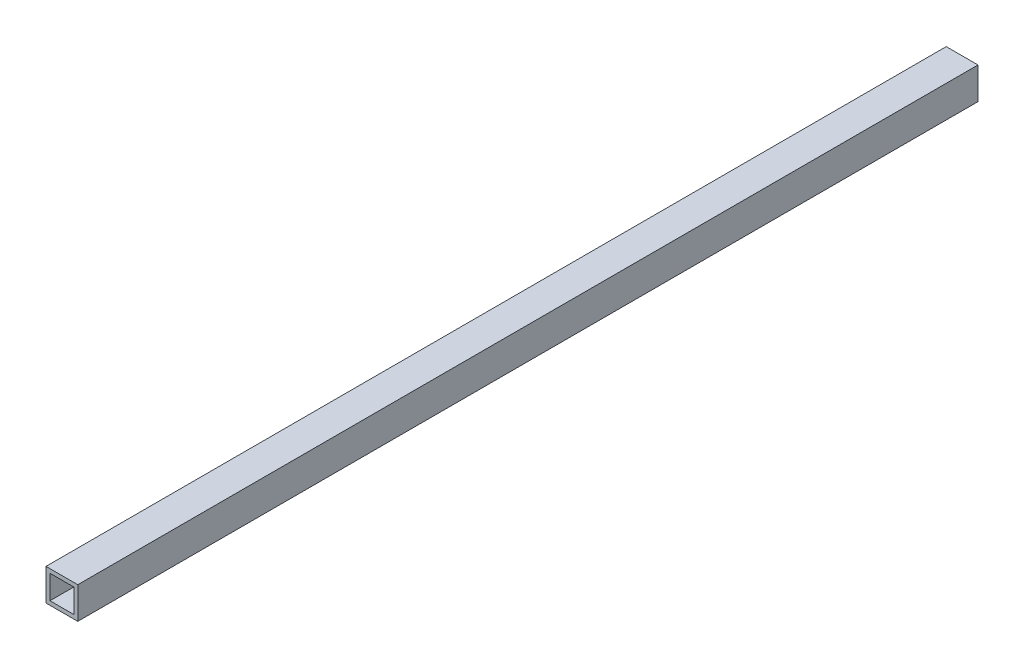
ISO-10303-21;
HEADER;
FILE_DESCRIPTION(('STEP AP214'),'2;1');
FILE_NAME('part.step','',(''),(''),'','','');
FILE_SCHEMA(('AUTOMOTIVE_DESIGN { 1 0 10303 214 1 1 1 1 }'));
ENDSEC;
DATA;
#1=APPLICATION_CONTEXT('core data for automotive mechanical design processes');
#2=APPLICATION_PROTOCOL_DEFINITION('international standard','automotive_design',2000,#1);
#3=PRODUCT_CONTEXT('',#1,'mechanical');
#4=PRODUCT('Part','Part','',(#3));
#5=PRODUCT_RELATED_PRODUCT_CATEGORY('part','',(#4));
#6=PRODUCT_DEFINITION_FORMATION('','',#4);
#7=PRODUCT_DEFINITION_CONTEXT('part definition',#1,'design');
#8=PRODUCT_DEFINITION('design','',#6,#7);
#9=PRODUCT_DEFINITION_SHAPE('','',#8);
#10=(LENGTH_UNIT() NAMED_UNIT(*) SI_UNIT(.MILLI.,.METRE.));
#11=(NAMED_UNIT(*) PLANE_ANGLE_UNIT() SI_UNIT($,.RADIAN.));
#12=(NAMED_UNIT(*) SI_UNIT($,.STERADIAN.) SOLID_ANGLE_UNIT());
#13=UNCERTAINTY_MEASURE_WITH_UNIT(LENGTH_MEASURE(1.E-05),#10,'distance_accuracy_value','');
#14=(GEOMETRIC_REPRESENTATION_CONTEXT(3) GLOBAL_UNCERTAINTY_ASSIGNED_CONTEXT((#13)) GLOBAL_UNIT_ASSIGNED_CONTEXT((#10,
#11,#12)) REPRESENTATION_CONTEXT('',''));
#15=CARTESIAN_POINT('',(0.,0.,0.));
#16=DIRECTION('',(0.,0.,1.));
#17=DIRECTION('',(1.,0.,0.));
#18=AXIS2_PLACEMENT_3D('',#15,#16,#17);
#19=CARTESIAN_POINT('',(0.,0.,340.));
#20=DIRECTION('',(0.,0.,-1.));
#21=DIRECTION('',(-1.,0.,0.));
#22=AXIS2_PLACEMENT_3D('',#19,#20,#21);
#23=PLANE('',#22);
#24=DIRECTION('',(0.,-1.,0.));
#25=VECTOR('',#24,1.);
#26=CARTESIAN_POINT('',(0.,0.,340.));
#27=LINE('',#26,#25);
#28=CARTESIAN_POINT('',(0.,12.,340.));
#29=VERTEX_POINT('',#28);
#30=CARTESIAN_POINT('',(0.,0.,340.));
#31=VERTEX_POINT('',#30);
#32=EDGE_CURVE('E134',#29,#31,#27,.T.);
#33=ORIENTED_EDGE('',*,*,#32,.T.);
#34=DIRECTION('',(1.,0.,0.));
#35=VECTOR('',#34,1.);
#36=CARTESIAN_POINT('',(0.,0.,340.));
#37=LINE('',#36,#35);
#38=CARTESIAN_POINT('',(12.,0.,340.));
#39=VERTEX_POINT('',#38);
#40=EDGE_CURVE('E137',#31,#39,#37,.T.);
#41=ORIENTED_EDGE('',*,*,#40,.T.);
#42=DIRECTION('',(0.,1.,0.));
#43=VECTOR('',#42,1.);
#44=CARTESIAN_POINT('',(12.,0.,340.));
#45=LINE('',#44,#43);
#46=CARTESIAN_POINT('',(12.,12.,340.));
#47=VERTEX_POINT('',#46);
#48=EDGE_CURVE('E140',#39,#47,#45,.T.);
#49=ORIENTED_EDGE('',*,*,#48,.T.);
#50=DIRECTION('',(-1.,0.,0.));
#51=VECTOR('',#50,1.);
#52=CARTESIAN_POINT('',(0.,12.,340.));
#53=LINE('',#52,#51);
#54=EDGE_CURVE('E142',#47,#29,#53,.T.);
#55=ORIENTED_EDGE('',*,*,#54,.T.);
#56=EDGE_LOOP('',(#33,#41,#49,#55));
#57=FACE_BOUND('',#56,.T.);
#58=DIRECTION('',(0.,1.,0.));
#59=VECTOR('',#58,1.);
#60=CARTESIAN_POINT('',(10.5,1.5,340.));
#61=LINE('',#60,#59);
#62=CARTESIAN_POINT('',(10.5,1.5,340.));
#63=VERTEX_POINT('',#62);
#64=CARTESIAN_POINT('',(10.5,10.5,340.));
#65=VERTEX_POINT('',#64);
#66=EDGE_CURVE('E98',#63,#65,#61,.T.);
#67=ORIENTED_EDGE('',*,*,#66,.F.);
#68=DIRECTION('',(1.,0.,0.));
#69=VECTOR('',#68,1.);
#70=CARTESIAN_POINT('',(1.5,1.5,340.));
#71=LINE('',#70,#69);
#72=CARTESIAN_POINT('',(1.5,1.5,340.));
#73=VERTEX_POINT('',#72);
#74=EDGE_CURVE('E120',#73,#63,#71,.T.);
#75=ORIENTED_EDGE('',*,*,#74,.F.);
#76=DIRECTION('',(0.,-1.,0.));
#77=VECTOR('',#76,1.);
#78=CARTESIAN_POINT('',(1.5,1.5,340.));
#79=LINE('',#78,#77);
#80=CARTESIAN_POINT('',(1.5,10.5,340.));
#81=VERTEX_POINT('',#80);
#82=EDGE_CURVE('E118',#81,#73,#79,.T.);
#83=ORIENTED_EDGE('',*,*,#82,.F.);
#84=DIRECTION('',(-1.,0.,0.));
#85=VECTOR('',#84,1.);
#86=CARTESIAN_POINT('',(1.5,10.5,340.));
#87=LINE('',#86,#85);
#88=EDGE_CURVE('E106',#65,#81,#87,.T.);
#89=ORIENTED_EDGE('',*,*,#88,.F.);
#90=EDGE_LOOP('',(#67,#75,#83,#89));
#91=FACE_BOUND('',#90,.T.);
#92=ADVANCED_FACE('F33',(#57,#91),#23,.F.);
#93=CARTESIAN_POINT('',(0.,0.,0.));
#94=DIRECTION('',(0.,0.,-1.));
#95=DIRECTION('',(-1.,0.,0.));
#96=AXIS2_PLACEMENT_3D('',#93,#94,#95);
#97=PLANE('',#96);
#98=DIRECTION('',(0.,-1.,0.));
#99=VECTOR('',#98,1.);
#100=CARTESIAN_POINT('',(0.,0.,0.));
#101=LINE('',#100,#99);
#102=CARTESIAN_POINT('',(0.,12.,0.));
#103=VERTEX_POINT('',#102);
#104=CARTESIAN_POINT('',(0.,0.,0.));
#105=VERTEX_POINT('',#104);
#106=EDGE_CURVE('E114',#103,#105,#101,.T.);
#107=ORIENTED_EDGE('',*,*,#106,.F.);
#108=DIRECTION('',(-1.,0.,0.));
#109=VECTOR('',#108,1.);
#110=CARTESIAN_POINT('',(0.,12.,0.));
#111=LINE('',#110,#109);
#112=CARTESIAN_POINT('',(12.,12.,0.));
#113=VERTEX_POINT('',#112);
#114=EDGE_CURVE('E138',#113,#103,#111,.T.);
#115=ORIENTED_EDGE('',*,*,#114,.F.);
#116=DIRECTION('',(0.,1.,0.));
#117=VECTOR('',#116,1.);
#118=CARTESIAN_POINT('',(12.,0.,0.));
#119=LINE('',#118,#117);
#120=CARTESIAN_POINT('',(12.,0.,0.));
#121=VERTEX_POINT('',#120);
#122=EDGE_CURVE('E149',#121,#113,#119,.T.);
#123=ORIENTED_EDGE('',*,*,#122,.F.);
#124=DIRECTION('',(1.,0.,0.));
#125=VECTOR('',#124,1.);
#126=CARTESIAN_POINT('',(0.,0.,0.));
#127=LINE('',#126,#125);
#128=EDGE_CURVE('E147',#105,#121,#127,.T.);
#129=ORIENTED_EDGE('',*,*,#128,.F.);
#130=EDGE_LOOP('',(#107,#115,#123,#129));
#131=FACE_BOUND('',#130,.T.);
#132=DIRECTION('',(1.,0.,0.));
#133=VECTOR('',#132,1.);
#134=CARTESIAN_POINT('',(1.5,1.5,0.));
#135=LINE('',#134,#133);
#136=CARTESIAN_POINT('',(1.5,1.5,0.));
#137=VERTEX_POINT('',#136);
#138=CARTESIAN_POINT('',(10.5,1.5,0.));
#139=VERTEX_POINT('',#138);
#140=EDGE_CURVE('E107',#137,#139,#135,.T.);
#141=ORIENTED_EDGE('',*,*,#140,.T.);
#142=DIRECTION('',(0.,1.,0.));
#143=VECTOR('',#142,1.);
#144=CARTESIAN_POINT('',(10.5,1.5,0.));
#145=LINE('',#144,#143);
#146=CARTESIAN_POINT('',(10.5,10.5,0.));
#147=VERTEX_POINT('',#146);
#148=EDGE_CURVE('E56',#139,#147,#145,.T.);
#149=ORIENTED_EDGE('',*,*,#148,.T.);
#150=DIRECTION('',(-1.,0.,0.));
#151=VECTOR('',#150,1.);
#152=CARTESIAN_POINT('',(1.5,10.5,0.));
#153=LINE('',#152,#151);
#154=CARTESIAN_POINT('',(1.5,10.5,0.));
#155=VERTEX_POINT('',#154);
#156=EDGE_CURVE('E113',#147,#155,#153,.T.);
#157=ORIENTED_EDGE('',*,*,#156,.T.);
#158=DIRECTION('',(0.,-1.,0.));
#159=VECTOR('',#158,1.);
#160=CARTESIAN_POINT('',(1.5,1.5,0.));
#161=LINE('',#160,#159);
#162=EDGE_CURVE('E126',#155,#137,#161,.T.);
#163=ORIENTED_EDGE('',*,*,#162,.T.);
#164=EDGE_LOOP('',(#141,#149,#157,#163));
#165=FACE_BOUND('',#164,.T.);
#166=ADVANCED_FACE('F167',(#131,#165),#97,.T.);
#167=CARTESIAN_POINT('',(0.,0.,340.));
#168=DIRECTION('',(1.,0.,0.));
#169=DIRECTION('',(0.,0.,-1.));
#170=AXIS2_PLACEMENT_3D('',#167,#168,#169);
#171=PLANE('',#170);
#172=ORIENTED_EDGE('',*,*,#106,.T.);
#173=DIRECTION('',(0.,0.,-1.));
#174=VECTOR('',#173,1.);
#175=CARTESIAN_POINT('',(0.,0.,340.));
#176=LINE('',#175,#174);
#177=EDGE_CURVE('E11',#31,#105,#176,.T.);
#178=ORIENTED_EDGE('',*,*,#177,.F.);
#179=ORIENTED_EDGE('',*,*,#32,.F.);
#180=DIRECTION('',(0.,0.,-1.));
#181=VECTOR('',#180,1.);
#182=CARTESIAN_POINT('',(0.,12.,340.));
#183=LINE('',#182,#181);
#184=EDGE_CURVE('E144',#29,#103,#183,.T.);
#185=ORIENTED_EDGE('',*,*,#184,.T.);
#186=EDGE_LOOP('',(#172,#178,#179,#185));
#187=FACE_BOUND('',#186,.T.);
#188=ADVANCED_FACE('F35',(#187),#171,.F.);
#189=CARTESIAN_POINT('',(0.,0.,340.));
#190=DIRECTION('',(0.,1.,0.));
#191=DIRECTION('',(0.,0.,1.));
#192=AXIS2_PLACEMENT_3D('',#189,#190,#191);
#193=PLANE('',#192);
#194=ORIENTED_EDGE('',*,*,#128,.T.);
#195=DIRECTION('',(0.,0.,-1.));
#196=VECTOR('',#195,1.);
#197=CARTESIAN_POINT('',(12.,0.,340.));
#198=LINE('',#197,#196);
#199=EDGE_CURVE('E41',#39,#121,#198,.T.);
#200=ORIENTED_EDGE('',*,*,#199,.F.);
#201=ORIENTED_EDGE('',*,*,#40,.F.);
#202=ORIENTED_EDGE('',*,*,#177,.T.);
#203=EDGE_LOOP('',(#194,#200,#201,#202));
#204=FACE_BOUND('',#203,.T.);
#205=ADVANCED_FACE('F177',(#204),#193,.F.);
#206=CARTESIAN_POINT('',(12.,0.,340.));
#207=DIRECTION('',(-1.,0.,0.));
#208=DIRECTION('',(0.,0.,1.));
#209=AXIS2_PLACEMENT_3D('',#206,#207,#208);
#210=PLANE('',#209);
#211=ORIENTED_EDGE('',*,*,#122,.T.);
#212=DIRECTION('',(0.,0.,-1.));
#213=VECTOR('',#212,1.);
#214=CARTESIAN_POINT('',(12.,12.,340.));
#215=LINE('',#214,#213);
#216=EDGE_CURVE('E154',#47,#113,#215,.T.);
#217=ORIENTED_EDGE('',*,*,#216,.F.);
#218=ORIENTED_EDGE('',*,*,#48,.F.);
#219=ORIENTED_EDGE('',*,*,#199,.T.);
#220=EDGE_LOOP('',(#211,#217,#218,#219));
#221=FACE_BOUND('',#220,.T.);
#222=ADVANCED_FACE('F161',(#221),#210,.F.);
#223=CARTESIAN_POINT('',(0.,12.,340.));
#224=DIRECTION('',(0.,-1.,0.));
#225=DIRECTION('',(0.,0.,-1.));
#226=AXIS2_PLACEMENT_3D('',#223,#224,#225);
#227=PLANE('',#226);
#228=ORIENTED_EDGE('',*,*,#114,.T.);
#229=ORIENTED_EDGE('',*,*,#184,.F.);
#230=ORIENTED_EDGE('',*,*,#54,.F.);
#231=ORIENTED_EDGE('',*,*,#216,.T.);
#232=EDGE_LOOP('',(#228,#229,#230,#231));
#233=FACE_BOUND('',#232,.T.);
#234=ADVANCED_FACE('F171',(#233),#227,.F.);
#235=CARTESIAN_POINT('',(10.5,1.5,340.));
#236=DIRECTION('',(-1.,0.,0.));
#237=DIRECTION('',(0.,0.,1.));
#238=AXIS2_PLACEMENT_3D('',#235,#236,#237);
#239=PLANE('',#238);
#240=ORIENTED_EDGE('',*,*,#148,.F.);
#241=DIRECTION('',(0.,0.,-1.));
#242=VECTOR('',#241,1.);
#243=CARTESIAN_POINT('',(10.5,1.5,340.));
#244=LINE('',#243,#242);
#245=EDGE_CURVE('E102',#63,#139,#244,.T.);
#246=ORIENTED_EDGE('',*,*,#245,.F.);
#247=ORIENTED_EDGE('',*,*,#66,.T.);
#248=DIRECTION('',(0.,0.,-1.));
#249=VECTOR('',#248,1.);
#250=CARTESIAN_POINT('',(10.5,10.5,340.));
#251=LINE('',#250,#249);
#252=EDGE_CURVE('E101',#65,#147,#251,.T.);
#253=ORIENTED_EDGE('',*,*,#252,.T.);
#254=EDGE_LOOP('',(#240,#246,#247,#253));
#255=FACE_BOUND('',#254,.T.);
#256=ADVANCED_FACE('F100',(#255),#239,.T.);
#257=CARTESIAN_POINT('',(1.5,10.5,340.));
#258=DIRECTION('',(0.,-1.,0.));
#259=DIRECTION('',(0.,0.,-1.));
#260=AXIS2_PLACEMENT_3D('',#257,#258,#259);
#261=PLANE('',#260);
#262=ORIENTED_EDGE('',*,*,#156,.F.);
#263=ORIENTED_EDGE('',*,*,#252,.F.);
#264=ORIENTED_EDGE('',*,*,#88,.T.);
#265=DIRECTION('',(0.,0.,-1.));
#266=VECTOR('',#265,1.);
#267=CARTESIAN_POINT('',(1.5,10.5,340.));
#268=LINE('',#267,#266);
#269=EDGE_CURVE('E115',#81,#155,#268,.T.);
#270=ORIENTED_EDGE('',*,*,#269,.T.);
#271=EDGE_LOOP('',(#262,#263,#264,#270));
#272=FACE_BOUND('',#271,.T.);
#273=ADVANCED_FACE('F110',(#272),#261,.T.);
#274=CARTESIAN_POINT('',(1.5,1.5,340.));
#275=DIRECTION('',(1.,0.,0.));
#276=DIRECTION('',(0.,0.,-1.));
#277=AXIS2_PLACEMENT_3D('',#274,#275,#276);
#278=PLANE('',#277);
#279=ORIENTED_EDGE('',*,*,#162,.F.);
#280=ORIENTED_EDGE('',*,*,#269,.F.);
#281=ORIENTED_EDGE('',*,*,#82,.T.);
#282=DIRECTION('',(0.,0.,-1.));
#283=VECTOR('',#282,1.);
#284=CARTESIAN_POINT('',(1.5,1.5,340.));
#285=LINE('',#284,#283);
#286=EDGE_CURVE('E48',#73,#137,#285,.T.);
#287=ORIENTED_EDGE('',*,*,#286,.T.);
#288=EDGE_LOOP('',(#279,#280,#281,#287));
#289=FACE_BOUND('',#288,.T.);
#290=ADVANCED_FACE('F200',(#289),#278,.T.);
#291=CARTESIAN_POINT('',(1.5,1.5,340.));
#292=DIRECTION('',(0.,1.,0.));
#293=DIRECTION('',(0.,0.,1.));
#294=AXIS2_PLACEMENT_3D('',#291,#292,#293);
#295=PLANE('',#294);
#296=ORIENTED_EDGE('',*,*,#140,.F.);
#297=ORIENTED_EDGE('',*,*,#286,.F.);
#298=ORIENTED_EDGE('',*,*,#74,.T.);
#299=ORIENTED_EDGE('',*,*,#245,.T.);
#300=EDGE_LOOP('',(#296,#297,#298,#299));
#301=FACE_BOUND('',#300,.T.);
#302=ADVANCED_FACE('F204',(#301),#295,.T.);
#303=CLOSED_SHELL('',(#92,#166,#188,#205,#222,#234,#256,#273,#290,#302));
#304=MANIFOLD_SOLID_BREP('B2',#303);
#305=ADVANCED_BREP_SHAPE_REPRESENTATION('',(#18,#304),#14);
#306=SHAPE_DEFINITION_REPRESENTATION(#9,#305);
ENDSEC;
END-ISO-10303-21;
